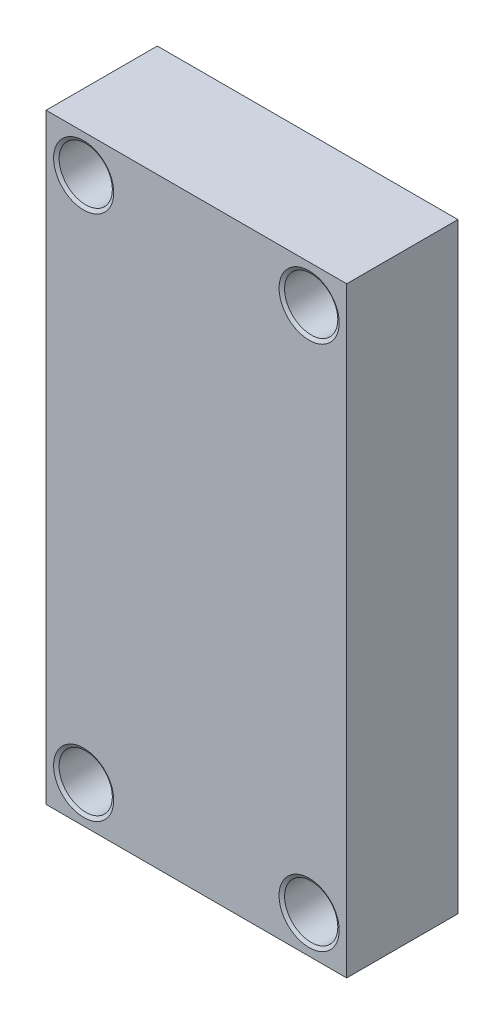
ISO-10303-21;
HEADER;
FILE_DESCRIPTION(('STEP AP214'),'2;1');
FILE_NAME('part.step','',(''),(''),'','','');
FILE_SCHEMA(('AUTOMOTIVE_DESIGN { 1 0 10303 214 1 1 1 1 }'));
ENDSEC;
DATA;
#1=APPLICATION_CONTEXT('core data for automotive mechanical design processes');
#2=APPLICATION_PROTOCOL_DEFINITION('international standard','automotive_design',2000,#1);
#3=PRODUCT_CONTEXT('',#1,'mechanical');
#4=PRODUCT('Part','Part','',(#3));
#5=PRODUCT_RELATED_PRODUCT_CATEGORY('part','',(#4));
#6=PRODUCT_DEFINITION_FORMATION('','',#4);
#7=PRODUCT_DEFINITION_CONTEXT('part definition',#1,'design');
#8=PRODUCT_DEFINITION('design','',#6,#7);
#9=PRODUCT_DEFINITION_SHAPE('','',#8);
#10=(LENGTH_UNIT() NAMED_UNIT(*) SI_UNIT(.MILLI.,.METRE.));
#11=(NAMED_UNIT(*) PLANE_ANGLE_UNIT() SI_UNIT($,.RADIAN.));
#12=(NAMED_UNIT(*) SI_UNIT($,.STERADIAN.) SOLID_ANGLE_UNIT());
#13=UNCERTAINTY_MEASURE_WITH_UNIT(LENGTH_MEASURE(1.E-05),#10,'distance_accuracy_value','');
#14=(GEOMETRIC_REPRESENTATION_CONTEXT(3) GLOBAL_UNCERTAINTY_ASSIGNED_CONTEXT((#13)) GLOBAL_UNIT_ASSIGNED_CONTEXT((#10,
#11,#12)) REPRESENTATION_CONTEXT('',''));
#15=CARTESIAN_POINT('',(0.,0.,0.));
#16=DIRECTION('',(0.,0.,1.));
#17=DIRECTION('',(1.,0.,0.));
#18=AXIS2_PLACEMENT_3D('',#15,#16,#17);
#19=CARTESIAN_POINT('',(9.52499999999999,22.225,9.398));
#20=DIRECTION('',(0.,0.,1.));
#21=DIRECTION('',(1.,0.,0.));
#22=AXIS2_PLACEMENT_3D('',#19,#20,#21);
#23=CONICAL_SURFACE('',#22,2.54,1.02974425867666);
#24=CARTESIAN_POINT('',(9.52499999999999,22.225,9.22248861318205));
#25=DIRECTION('',(0.,0.,1.));
#26=DIRECTION('',(1.,0.,0.));
#27=AXIS2_PLACEMENT_3D('',#24,#25,#26);
#28=CIRCLE('',#27,2.2479);
#29=CARTESIAN_POINT('',(11.7729,22.225,9.22248861318205));
#30=VERTEX_POINT('',#29);
#31=EDGE_CURVE('E13',#30,#30,#28,.T.);
#32=ORIENTED_EDGE('',*,*,#31,.F.);
#33=EDGE_LOOP('',(#32));
#34=FACE_BOUND('',#33,.T.);
#35=CARTESIAN_POINT('',(9.52499999999999,22.225,9.398));
#36=DIRECTION('',(0.,0.,1.));
#37=DIRECTION('',(1.,0.,0.));
#38=AXIS2_PLACEMENT_3D('',#35,#36,#37);
#39=CIRCLE('',#38,2.54);
#40=CARTESIAN_POINT('',(12.065,22.225,9.398));
#41=VERTEX_POINT('',#40);
#42=EDGE_CURVE('E136',#41,#41,#39,.T.);
#43=ORIENTED_EDGE('',*,*,#42,.T.);
#44=EDGE_LOOP('',(#43));
#45=FACE_BOUND('',#44,.T.);
#46=ADVANCED_FACE('F46',(#34,#45),#23,.F.);
#47=CARTESIAN_POINT('',(9.52499999999999,22.225,9.398));
#48=DIRECTION('',(0.,0.,1.));
#49=DIRECTION('',(1.,0.,0.));
#50=AXIS2_PLACEMENT_3D('',#47,#48,#49);
#51=CYLINDRICAL_SURFACE('',#50,2.2479);
#52=CARTESIAN_POINT('',(9.52499999999999,22.225,0.175511386817949));
#53=DIRECTION('',(0.,0.,1.));
#54=DIRECTION('',(1.,0.,0.));
#55=AXIS2_PLACEMENT_3D('',#52,#53,#54);
#56=CIRCLE('',#55,2.2479);
#57=CARTESIAN_POINT('',(11.7729,22.225,0.175511386817949));
#58=VERTEX_POINT('',#57);
#59=EDGE_CURVE('E54',#58,#58,#56,.T.);
#60=ORIENTED_EDGE('',*,*,#59,.F.);
#61=EDGE_LOOP('',(#60));
#62=FACE_BOUND('',#61,.T.);
#63=ORIENTED_EDGE('',*,*,#31,.T.);
#64=EDGE_LOOP('',(#63));
#65=FACE_BOUND('',#64,.T.);
#66=ADVANCED_FACE('F146',(#62,#65),#51,.F.);
#67=CARTESIAN_POINT('',(9.52499999999999,22.225,0.175511386817949));
#68=DIRECTION('',(0.,0.,-1.));
#69=DIRECTION('',(-1.,0.,0.));
#70=AXIS2_PLACEMENT_3D('',#67,#68,#69);
#71=CONICAL_SURFACE('',#70,2.2479,1.02974425867666);
#72=CARTESIAN_POINT('',(9.52499999999999,22.225,0.));
#73=DIRECTION('',(0.,0.,1.));
#74=DIRECTION('',(1.,0.,0.));
#75=AXIS2_PLACEMENT_3D('',#72,#73,#74);
#76=CIRCLE('',#75,2.54);
#77=CARTESIAN_POINT('',(12.065,22.225,0.));
#78=VERTEX_POINT('',#77);
#79=EDGE_CURVE('E139',#78,#78,#76,.T.);
#80=ORIENTED_EDGE('',*,*,#79,.F.);
#81=EDGE_LOOP('',(#80));
#82=FACE_BOUND('',#81,.T.);
#83=ORIENTED_EDGE('',*,*,#59,.T.);
#84=EDGE_LOOP('',(#83));
#85=FACE_BOUND('',#84,.T.);
#86=ADVANCED_FACE('F144',(#82,#85),#71,.F.);
#87=CARTESIAN_POINT('',(9.525,-22.225,9.398));
#88=DIRECTION('',(0.,0.,1.));
#89=DIRECTION('',(1.,0.,0.));
#90=AXIS2_PLACEMENT_3D('',#87,#88,#89);
#91=CONICAL_SURFACE('',#90,2.54,1.02974425867666);
#92=CARTESIAN_POINT('',(9.525,-22.225,9.22248861318205));
#93=DIRECTION('',(0.,0.,1.));
#94=DIRECTION('',(1.,0.,0.));
#95=AXIS2_PLACEMENT_3D('',#92,#93,#94);
#96=CIRCLE('',#95,2.2479);
#97=CARTESIAN_POINT('',(11.7729,-22.225,9.22248861318205));
#98=VERTEX_POINT('',#97);
#99=EDGE_CURVE('E133',#98,#98,#96,.T.);
#100=ORIENTED_EDGE('',*,*,#99,.F.);
#101=EDGE_LOOP('',(#100));
#102=FACE_BOUND('',#101,.T.);
#103=CARTESIAN_POINT('',(9.525,-22.225,9.398));
#104=DIRECTION('',(0.,0.,1.));
#105=DIRECTION('',(1.,0.,0.));
#106=AXIS2_PLACEMENT_3D('',#103,#104,#105);
#107=CIRCLE('',#106,2.54);
#108=CARTESIAN_POINT('',(12.065,-22.225,9.398));
#109=VERTEX_POINT('',#108);
#110=EDGE_CURVE('E124',#109,#109,#107,.T.);
#111=ORIENTED_EDGE('',*,*,#110,.T.);
#112=EDGE_LOOP('',(#111));
#113=FACE_BOUND('',#112,.T.);
#114=ADVANCED_FACE('F188',(#102,#113),#91,.F.);
#115=CARTESIAN_POINT('',(9.525,-22.225,9.398));
#116=DIRECTION('',(0.,0.,1.));
#117=DIRECTION('',(1.,0.,0.));
#118=AXIS2_PLACEMENT_3D('',#115,#116,#117);
#119=CYLINDRICAL_SURFACE('',#118,2.2479);
#120=CARTESIAN_POINT('',(9.525,-22.225,0.175511386817949));
#121=DIRECTION('',(0.,0.,1.));
#122=DIRECTION('',(1.,0.,0.));
#123=AXIS2_PLACEMENT_3D('',#120,#121,#122);
#124=CIRCLE('',#123,2.2479);
#125=CARTESIAN_POINT('',(11.7729,-22.225,0.175511386817949));
#126=VERTEX_POINT('',#125);
#127=EDGE_CURVE('E130',#126,#126,#124,.T.);
#128=ORIENTED_EDGE('',*,*,#127,.F.);
#129=EDGE_LOOP('',(#128));
#130=FACE_BOUND('',#129,.T.);
#131=ORIENTED_EDGE('',*,*,#99,.T.);
#132=EDGE_LOOP('',(#131));
#133=FACE_BOUND('',#132,.T.);
#134=ADVANCED_FACE('F184',(#130,#133),#119,.F.);
#135=CARTESIAN_POINT('',(9.525,-22.225,0.175511386817949));
#136=DIRECTION('',(0.,0.,-1.));
#137=DIRECTION('',(-1.,0.,0.));
#138=AXIS2_PLACEMENT_3D('',#135,#136,#137);
#139=CONICAL_SURFACE('',#138,2.2479,1.02974425867666);
#140=CARTESIAN_POINT('',(9.525,-22.225,0.));
#141=DIRECTION('',(0.,0.,1.));
#142=DIRECTION('',(1.,0.,0.));
#143=AXIS2_PLACEMENT_3D('',#140,#141,#142);
#144=CIRCLE('',#143,2.54);
#145=CARTESIAN_POINT('',(12.065,-22.225,0.));
#146=VERTEX_POINT('',#145);
#147=EDGE_CURVE('E127',#146,#146,#144,.T.);
#148=ORIENTED_EDGE('',*,*,#147,.F.);
#149=EDGE_LOOP('',(#148));
#150=FACE_BOUND('',#149,.T.);
#151=ORIENTED_EDGE('',*,*,#127,.T.);
#152=EDGE_LOOP('',(#151));
#153=FACE_BOUND('',#152,.T.);
#154=ADVANCED_FACE('F180',(#150,#153),#139,.F.);
#155=CARTESIAN_POINT('',(12.7,25.4,9.398));
#156=DIRECTION('',(-1.,0.,0.));
#157=DIRECTION('',(0.,-1.,0.));
#158=AXIS2_PLACEMENT_3D('',#155,#156,#157);
#159=PLANE('',#158);
#160=DIRECTION('',(0.,1.,0.));
#161=VECTOR('',#160,1.);
#162=CARTESIAN_POINT('',(12.7,25.4,0.));
#163=LINE('',#162,#161);
#164=CARTESIAN_POINT('',(12.7,-25.4,0.));
#165=VERTEX_POINT('',#164);
#166=CARTESIAN_POINT('',(12.7,25.4,0.));
#167=VERTEX_POINT('',#166);
#168=EDGE_CURVE('E114',#165,#167,#163,.T.);
#169=ORIENTED_EDGE('',*,*,#168,.T.);
#170=DIRECTION('',(0.,0.,-1.));
#171=VECTOR('',#170,1.);
#172=CARTESIAN_POINT('',(12.7,25.4,9.398));
#173=LINE('',#172,#171);
#174=CARTESIAN_POINT('',(12.7,25.4,9.398));
#175=VERTEX_POINT('',#174);
#176=EDGE_CURVE('E105',#175,#167,#173,.T.);
#177=ORIENTED_EDGE('',*,*,#176,.F.);
#178=DIRECTION('',(0.,1.,0.));
#179=VECTOR('',#178,1.);
#180=CARTESIAN_POINT('',(12.7,25.4,9.398));
#181=LINE('',#180,#179);
#182=CARTESIAN_POINT('',(12.7,-25.4,9.398));
#183=VERTEX_POINT('',#182);
#184=EDGE_CURVE('E99',#183,#175,#181,.T.);
#185=ORIENTED_EDGE('',*,*,#184,.F.);
#186=DIRECTION('',(0.,0.,-1.));
#187=VECTOR('',#186,1.);
#188=CARTESIAN_POINT('',(12.7,-25.4,9.398));
#189=LINE('',#188,#187);
#190=EDGE_CURVE('E110',#183,#165,#189,.T.);
#191=ORIENTED_EDGE('',*,*,#190,.T.);
#192=EDGE_LOOP('',(#169,#177,#185,#191));
#193=FACE_BOUND('',#192,.T.);
#194=ADVANCED_FACE('F177',(#193),#159,.F.);
#195=CARTESIAN_POINT('',(-12.7,25.4,9.398));
#196=DIRECTION('',(0.,-1.,0.));
#197=DIRECTION('',(0.,0.,-1.));
#198=AXIS2_PLACEMENT_3D('',#195,#196,#197);
#199=PLANE('',#198);
#200=DIRECTION('',(-1.,0.,0.));
#201=VECTOR('',#200,1.);
#202=CARTESIAN_POINT('',(-12.7,25.4,0.));
#203=LINE('',#202,#201);
#204=CARTESIAN_POINT('',(-12.7,25.4,0.));
#205=VERTEX_POINT('',#204);
#206=EDGE_CURVE('E104',#167,#205,#203,.T.);
#207=ORIENTED_EDGE('',*,*,#206,.T.);
#208=DIRECTION('',(0.,0.,-1.));
#209=VECTOR('',#208,1.);
#210=CARTESIAN_POINT('',(-12.7,25.4,9.398));
#211=LINE('',#210,#209);
#212=CARTESIAN_POINT('',(-12.7,25.4,9.398));
#213=VERTEX_POINT('',#212);
#214=EDGE_CURVE('E102',#213,#205,#211,.T.);
#215=ORIENTED_EDGE('',*,*,#214,.F.);
#216=DIRECTION('',(-1.,0.,0.));
#217=VECTOR('',#216,1.);
#218=CARTESIAN_POINT('',(-12.7,25.4,9.398));
#219=LINE('',#218,#217);
#220=EDGE_CURVE('E93',#175,#213,#219,.T.);
#221=ORIENTED_EDGE('',*,*,#220,.F.);
#222=ORIENTED_EDGE('',*,*,#176,.T.);
#223=EDGE_LOOP('',(#207,#215,#221,#222));
#224=FACE_BOUND('',#223,.T.);
#225=ADVANCED_FACE('F103',(#224),#199,.F.);
#226=CARTESIAN_POINT('',(-12.7,25.4,9.398));
#227=DIRECTION('',(1.,0.,0.));
#228=DIRECTION('',(0.,1.,0.));
#229=AXIS2_PLACEMENT_3D('',#226,#227,#228);
#230=PLANE('',#229);
#231=DIRECTION('',(0.,-1.,0.));
#232=VECTOR('',#231,1.);
#233=CARTESIAN_POINT('',(-12.7,25.4,0.));
#234=LINE('',#233,#232);
#235=CARTESIAN_POINT('',(-12.7,-25.4,0.));
#236=VERTEX_POINT('',#235);
#237=EDGE_CURVE('E79',#205,#236,#234,.T.);
#238=ORIENTED_EDGE('',*,*,#237,.T.);
#239=DIRECTION('',(0.,0.,-1.));
#240=VECTOR('',#239,1.);
#241=CARTESIAN_POINT('',(-12.7,-25.4,9.398));
#242=LINE('',#241,#240);
#243=CARTESIAN_POINT('',(-12.7,-25.4,9.398));
#244=VERTEX_POINT('',#243);
#245=EDGE_CURVE('E106',#244,#236,#242,.T.);
#246=ORIENTED_EDGE('',*,*,#245,.F.);
#247=DIRECTION('',(0.,-1.,0.));
#248=VECTOR('',#247,1.);
#249=CARTESIAN_POINT('',(-12.7,25.4,9.398));
#250=LINE('',#249,#248);
#251=EDGE_CURVE('E97',#213,#244,#250,.T.);
#252=ORIENTED_EDGE('',*,*,#251,.F.);
#253=ORIENTED_EDGE('',*,*,#214,.T.);
#254=EDGE_LOOP('',(#238,#246,#252,#253));
#255=FACE_BOUND('',#254,.T.);
#256=ADVANCED_FACE('F108',(#255),#230,.F.);
#257=CARTESIAN_POINT('',(-12.7,-25.4,9.398));
#258=DIRECTION('',(0.,1.,0.));
#259=DIRECTION('',(0.,0.,1.));
#260=AXIS2_PLACEMENT_3D('',#257,#258,#259);
#261=PLANE('',#260);
#262=DIRECTION('',(1.,0.,0.));
#263=VECTOR('',#262,1.);
#264=CARTESIAN_POINT('',(-12.7,-25.4,0.));
#265=LINE('',#264,#263);
#266=EDGE_CURVE('E85',#236,#165,#265,.T.);
#267=ORIENTED_EDGE('',*,*,#266,.T.);
#268=ORIENTED_EDGE('',*,*,#190,.F.);
#269=DIRECTION('',(1.,0.,0.));
#270=VECTOR('',#269,1.);
#271=CARTESIAN_POINT('',(-12.7,-25.4,9.398));
#272=LINE('',#271,#270);
#273=EDGE_CURVE('E62',#244,#183,#272,.T.);
#274=ORIENTED_EDGE('',*,*,#273,.F.);
#275=ORIENTED_EDGE('',*,*,#245,.T.);
#276=EDGE_LOOP('',(#267,#268,#274,#275));
#277=FACE_BOUND('',#276,.T.);
#278=ADVANCED_FACE('F157',(#277),#261,.F.);
#279=CARTESIAN_POINT('',(0.,0.,9.398));
#280=DIRECTION('',(0.,0.,1.));
#281=DIRECTION('',(1.,0.,0.));
#282=AXIS2_PLACEMENT_3D('',#279,#280,#281);
#283=PLANE('',#282);
#284=CARTESIAN_POINT('',(-9.52500000000001,22.225,9.398));
#285=DIRECTION('',(0.,0.,1.));
#286=DIRECTION('',(1.,0.,0.));
#287=AXIS2_PLACEMENT_3D('',#284,#285,#286);
#288=CIRCLE('',#287,2.54);
#289=CARTESIAN_POINT('',(-6.98500000000001,22.225,9.398));
#290=VERTEX_POINT('',#289);
#291=EDGE_CURVE('E316',#290,#290,#288,.T.);
#292=ORIENTED_EDGE('',*,*,#291,.F.);
#293=EDGE_LOOP('',(#292));
#294=FACE_BOUND('',#293,.T.);
#295=CARTESIAN_POINT('',(-9.52500000000001,-22.225,9.398));
#296=DIRECTION('',(0.,0.,1.));
#297=DIRECTION('',(1.,0.,0.));
#298=AXIS2_PLACEMENT_3D('',#295,#296,#297);
#299=CIRCLE('',#298,2.54);
#300=CARTESIAN_POINT('',(-6.985,-22.225,9.398));
#301=VERTEX_POINT('',#300);
#302=EDGE_CURVE('E329',#301,#301,#299,.T.);
#303=ORIENTED_EDGE('',*,*,#302,.F.);
#304=EDGE_LOOP('',(#303));
#305=FACE_BOUND('',#304,.T.);
#306=ORIENTED_EDGE('',*,*,#184,.T.);
#307=ORIENTED_EDGE('',*,*,#220,.T.);
#308=ORIENTED_EDGE('',*,*,#251,.T.);
#309=ORIENTED_EDGE('',*,*,#273,.T.);
#310=EDGE_LOOP('',(#306,#307,#308,#309));
#311=FACE_BOUND('',#310,.T.);
#312=ORIENTED_EDGE('',*,*,#110,.F.);
#313=EDGE_LOOP('',(#312));
#314=FACE_BOUND('',#313,.T.);
#315=ORIENTED_EDGE('',*,*,#42,.F.);
#316=EDGE_LOOP('',(#315));
#317=FACE_BOUND('',#316,.T.);
#318=ADVANCED_FACE('F94',(#294,#305,#311,#314,#317),#283,.T.);
#319=CARTESIAN_POINT('',(0.,0.,0.));
#320=DIRECTION('',(0.,0.,1.));
#321=DIRECTION('',(1.,0.,0.));
#322=AXIS2_PLACEMENT_3D('',#319,#320,#321);
#323=PLANE('',#322);
#324=CARTESIAN_POINT('',(-9.52500000000001,22.225,0.));
#325=DIRECTION('',(0.,0.,1.));
#326=DIRECTION('',(1.,0.,0.));
#327=AXIS2_PLACEMENT_3D('',#324,#325,#326);
#328=CIRCLE('',#327,2.54);
#329=CARTESIAN_POINT('',(-6.98500000000001,22.225,0.));
#330=VERTEX_POINT('',#329);
#331=EDGE_CURVE('E317',#330,#330,#328,.T.);
#332=ORIENTED_EDGE('',*,*,#331,.T.);
#333=EDGE_LOOP('',(#332));
#334=FACE_BOUND('',#333,.T.);
#335=CARTESIAN_POINT('',(-9.52500000000001,-22.225,0.));
#336=DIRECTION('',(0.,0.,1.));
#337=DIRECTION('',(1.,0.,0.));
#338=AXIS2_PLACEMENT_3D('',#335,#336,#337);
#339=CIRCLE('',#338,2.54);
#340=CARTESIAN_POINT('',(-6.98500000000001,-22.225,0.));
#341=VERTEX_POINT('',#340);
#342=EDGE_CURVE('E326',#341,#341,#339,.T.);
#343=ORIENTED_EDGE('',*,*,#342,.T.);
#344=EDGE_LOOP('',(#343));
#345=FACE_BOUND('',#344,.T.);
#346=ORIENTED_EDGE('',*,*,#168,.F.);
#347=ORIENTED_EDGE('',*,*,#266,.F.);
#348=ORIENTED_EDGE('',*,*,#237,.F.);
#349=ORIENTED_EDGE('',*,*,#206,.F.);
#350=EDGE_LOOP('',(#346,#347,#348,#349));
#351=FACE_BOUND('',#350,.T.);
#352=ORIENTED_EDGE('',*,*,#147,.T.);
#353=EDGE_LOOP('',(#352));
#354=FACE_BOUND('',#353,.T.);
#355=ORIENTED_EDGE('',*,*,#79,.T.);
#356=EDGE_LOOP('',(#355));
#357=FACE_BOUND('',#356,.T.);
#358=ADVANCED_FACE('F156',(#334,#345,#351,#354,#357),#323,.F.);
#359=CARTESIAN_POINT('',(-9.52500000000001,-22.225,0.175511386817949));
#360=DIRECTION('',(0.,0.,-1.));
#361=DIRECTION('',(-1.,0.,0.));
#362=AXIS2_PLACEMENT_3D('',#359,#360,#361);
#363=CONICAL_SURFACE('',#362,2.2479,1.02974425867666);
#364=ORIENTED_EDGE('',*,*,#342,.F.);
#365=EDGE_LOOP('',(#364));
#366=FACE_BOUND('',#365,.T.);
#367=CARTESIAN_POINT('',(-9.52500000000001,-22.225,0.175511386817949));
#368=DIRECTION('',(0.,0.,1.));
#369=DIRECTION('',(1.,0.,0.));
#370=AXIS2_PLACEMENT_3D('',#367,#368,#369);
#371=CIRCLE('',#370,2.2479);
#372=CARTESIAN_POINT('',(-7.27710000000001,-22.225,0.175511386817949));
#373=VERTEX_POINT('',#372);
#374=EDGE_CURVE('E117',#373,#373,#371,.T.);
#375=ORIENTED_EDGE('',*,*,#374,.T.);
#376=EDGE_LOOP('',(#375));
#377=FACE_BOUND('',#376,.T.);
#378=ADVANCED_FACE('F164',(#366,#377),#363,.F.);
#379=CARTESIAN_POINT('',(-9.52500000000001,-22.225,9.398));
#380=DIRECTION('',(0.,0.,1.));
#381=DIRECTION('',(1.,0.,0.));
#382=AXIS2_PLACEMENT_3D('',#379,#380,#381);
#383=CYLINDRICAL_SURFACE('',#382,2.2479);
#384=ORIENTED_EDGE('',*,*,#374,.F.);
#385=EDGE_LOOP('',(#384));
#386=FACE_BOUND('',#385,.T.);
#387=CARTESIAN_POINT('',(-9.52500000000001,-22.225,9.22248861318205));
#388=DIRECTION('',(0.,0.,1.));
#389=DIRECTION('',(1.,0.,0.));
#390=AXIS2_PLACEMENT_3D('',#387,#388,#389);
#391=CIRCLE('',#390,2.2479);
#392=CARTESIAN_POINT('',(-7.27710000000001,-22.225,9.22248861318205));
#393=VERTEX_POINT('',#392);
#394=EDGE_CURVE('E332',#393,#393,#391,.T.);
#395=ORIENTED_EDGE('',*,*,#394,.T.);
#396=EDGE_LOOP('',(#395));
#397=FACE_BOUND('',#396,.T.);
#398=ADVANCED_FACE('F239',(#386,#397),#383,.F.);
#399=CARTESIAN_POINT('',(-9.52500000000001,-22.225,9.398));
#400=DIRECTION('',(0.,0.,1.));
#401=DIRECTION('',(1.,0.,0.));
#402=AXIS2_PLACEMENT_3D('',#399,#400,#401);
#403=CONICAL_SURFACE('',#402,2.54,1.02974425867666);
#404=ORIENTED_EDGE('',*,*,#394,.F.);
#405=EDGE_LOOP('',(#404));
#406=FACE_BOUND('',#405,.T.);
#407=ORIENTED_EDGE('',*,*,#302,.T.);
#408=EDGE_LOOP('',(#407));
#409=FACE_BOUND('',#408,.T.);
#410=ADVANCED_FACE('F249',(#406,#409),#403,.F.);
#411=CARTESIAN_POINT('',(-9.52500000000001,22.225,0.175511386817949));
#412=DIRECTION('',(0.,0.,-1.));
#413=DIRECTION('',(-1.,0.,0.));
#414=AXIS2_PLACEMENT_3D('',#411,#412,#413);
#415=CONICAL_SURFACE('',#414,2.2479,1.02974425867666);
#416=ORIENTED_EDGE('',*,*,#331,.F.);
#417=EDGE_LOOP('',(#416));
#418=FACE_BOUND('',#417,.T.);
#419=CARTESIAN_POINT('',(-9.52500000000001,22.225,0.175511386817949));
#420=DIRECTION('',(0.,0.,1.));
#421=DIRECTION('',(1.,0.,0.));
#422=AXIS2_PLACEMENT_3D('',#419,#420,#421);
#423=CIRCLE('',#422,2.2479);
#424=CARTESIAN_POINT('',(-7.27710000000002,22.225,0.175511386817949));
#425=VERTEX_POINT('',#424);
#426=EDGE_CURVE('E323',#425,#425,#423,.T.);
#427=ORIENTED_EDGE('',*,*,#426,.T.);
#428=EDGE_LOOP('',(#427));
#429=FACE_BOUND('',#428,.T.);
#430=ADVANCED_FACE('F258',(#418,#429),#415,.F.);
#431=CARTESIAN_POINT('',(-9.52500000000001,22.225,9.398));
#432=DIRECTION('',(0.,0.,1.));
#433=DIRECTION('',(1.,0.,0.));
#434=AXIS2_PLACEMENT_3D('',#431,#432,#433);
#435=CYLINDRICAL_SURFACE('',#434,2.2479);
#436=ORIENTED_EDGE('',*,*,#426,.F.);
#437=EDGE_LOOP('',(#436));
#438=FACE_BOUND('',#437,.T.);
#439=CARTESIAN_POINT('',(-9.52500000000001,22.225,9.22248861318205));
#440=DIRECTION('',(0.,0.,1.));
#441=DIRECTION('',(1.,0.,0.));
#442=AXIS2_PLACEMENT_3D('',#439,#440,#441);
#443=CIRCLE('',#442,2.2479);
#444=CARTESIAN_POINT('',(-7.27710000000002,22.225,9.22248861318205));
#445=VERTEX_POINT('',#444);
#446=EDGE_CURVE('E314',#445,#445,#443,.T.);
#447=ORIENTED_EDGE('',*,*,#446,.T.);
#448=EDGE_LOOP('',(#447));
#449=FACE_BOUND('',#448,.T.);
#450=ADVANCED_FACE('F287',(#438,#449),#435,.F.);
#451=CARTESIAN_POINT('',(-9.52500000000001,22.225,9.398));
#452=DIRECTION('',(0.,0.,1.));
#453=DIRECTION('',(1.,0.,0.));
#454=AXIS2_PLACEMENT_3D('',#451,#452,#453);
#455=CONICAL_SURFACE('',#454,2.54,1.02974425867666);
#456=ORIENTED_EDGE('',*,*,#446,.F.);
#457=EDGE_LOOP('',(#456));
#458=FACE_BOUND('',#457,.T.);
#459=ORIENTED_EDGE('',*,*,#291,.T.);
#460=EDGE_LOOP('',(#459));
#461=FACE_BOUND('',#460,.T.);
#462=ADVANCED_FACE('F297',(#458,#461),#455,.F.);
#463=CLOSED_SHELL('',(#46,#66,#86,#114,#134,#154,#194,#225,#256,#278,#318,#358,#378,#398,#410,
#430,#450,#462));
#464=MANIFOLD_SOLID_BREP('B2',#463);
#465=ADVANCED_BREP_SHAPE_REPRESENTATION('',(#18,#464),#14);
#466=SHAPE_DEFINITION_REPRESENTATION(#9,#465);
ENDSEC;
END-ISO-10303-21;
